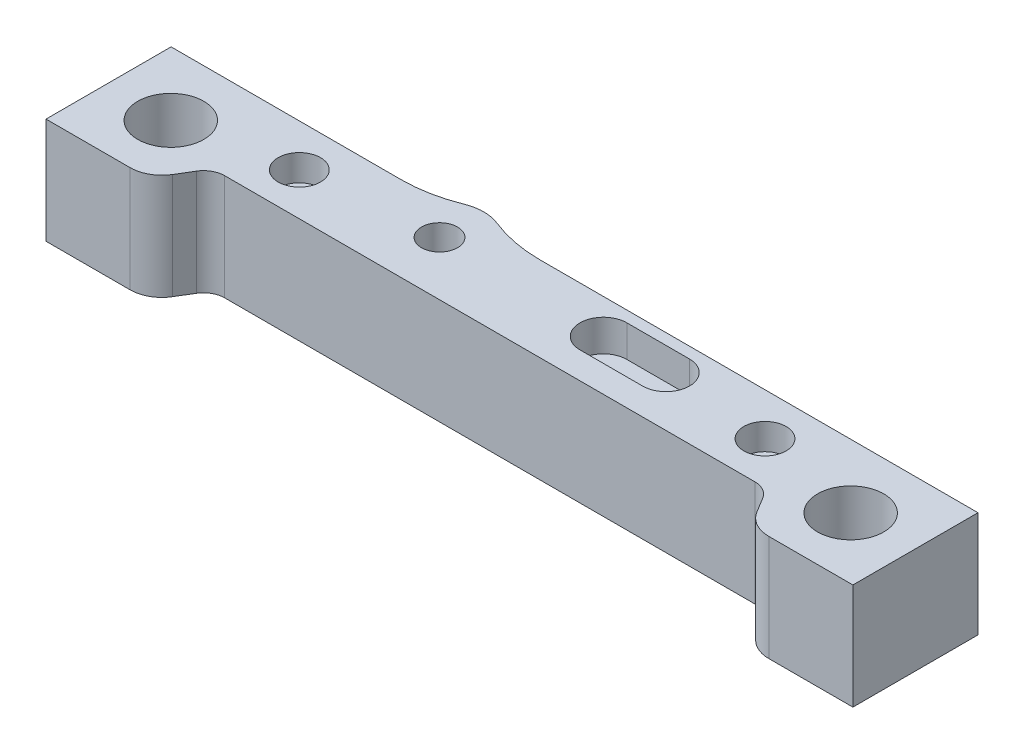
ISO-10303-21;
HEADER;
FILE_DESCRIPTION(('STEP AP214'),'2;1');
FILE_NAME('part.step','',(''),(''),'','','');
FILE_SCHEMA(('AUTOMOTIVE_DESIGN { 1 0 10303 214 1 1 1 1 }'));
ENDSEC;
DATA;
#1=APPLICATION_CONTEXT('core data for automotive mechanical design processes');
#2=APPLICATION_PROTOCOL_DEFINITION('international standard','automotive_design',2000,#1);
#3=PRODUCT_CONTEXT('',#1,'mechanical');
#4=PRODUCT('Part','Part','',(#3));
#5=PRODUCT_RELATED_PRODUCT_CATEGORY('part','',(#4));
#6=PRODUCT_DEFINITION_FORMATION('','',#4);
#7=PRODUCT_DEFINITION_CONTEXT('part definition',#1,'design');
#8=PRODUCT_DEFINITION('design','',#6,#7);
#9=PRODUCT_DEFINITION_SHAPE('','',#8);
#10=(LENGTH_UNIT() NAMED_UNIT(*) SI_UNIT(.MILLI.,.METRE.));
#11=(NAMED_UNIT(*) PLANE_ANGLE_UNIT() SI_UNIT($,.RADIAN.));
#12=(NAMED_UNIT(*) SI_UNIT($,.STERADIAN.) SOLID_ANGLE_UNIT());
#13=UNCERTAINTY_MEASURE_WITH_UNIT(LENGTH_MEASURE(1.E-05),#10,'distance_accuracy_value','');
#14=(GEOMETRIC_REPRESENTATION_CONTEXT(3) GLOBAL_UNCERTAINTY_ASSIGNED_CONTEXT((#13)) GLOBAL_UNIT_ASSIGNED_CONTEXT((#10,
#11,#12)) REPRESENTATION_CONTEXT('',''));
#15=CARTESIAN_POINT('',(0.,0.,0.));
#16=DIRECTION('',(0.,0.,1.));
#17=DIRECTION('',(1.,0.,0.));
#18=AXIS2_PLACEMENT_3D('',#15,#16,#17);
#19=CARTESIAN_POINT('',(22.,-14.2426406871193,-4.00499999999999));
#20=DIRECTION('',(0.,1.,0.));
#21=DIRECTION('',(0.,0.,1.));
#22=AXIS2_PLACEMENT_3D('',#19,#20,#21);
#23=CYLINDRICAL_SURFACE('',#22,1.5);
#24=CARTESIAN_POINT('',(22.,-2.48,-4.00499999999999));
#25=DIRECTION('',(0.,1.,0.));
#26=DIRECTION('',(0.,0.,1.));
#27=AXIS2_PLACEMENT_3D('',#24,#25,#26);
#28=CIRCLE('',#27,1.5);
#29=CARTESIAN_POINT('',(22.,-2.48,-2.50499999999999));
#30=VERTEX_POINT('',#29);
#31=EDGE_CURVE('E359',#30,#30,#28,.F.);
#32=ORIENTED_EDGE('',*,*,#31,.F.);
#33=EDGE_LOOP('',(#32));
#34=FACE_BOUND('',#33,.T.);
#35=CARTESIAN_POINT('',(22.,-7.2,-4.00499999999999));
#36=DIRECTION('',(0.,-1.,0.));
#37=DIRECTION('',(0.,0.,-1.));
#38=AXIS2_PLACEMENT_3D('',#35,#36,#37);
#39=CIRCLE('',#38,1.5);
#40=CARTESIAN_POINT('',(22.,-7.2,-5.50499999999999));
#41=VERTEX_POINT('',#40);
#42=EDGE_CURVE('E361',#41,#41,#39,.T.);
#43=ORIENTED_EDGE('',*,*,#42,.T.);
#44=EDGE_LOOP('',(#43));
#45=FACE_BOUND('',#44,.T.);
#46=ADVANCED_FACE('F43',(#34,#45),#23,.F.);
#47=CARTESIAN_POINT('',(0.,-10.,0.));
#48=DIRECTION('',(0.,1.,0.));
#49=DIRECTION('',(0.,0.,1.));
#50=AXIS2_PLACEMENT_3D('',#47,#48,#49);
#51=PLANE('',#50);
#52=CARTESIAN_POINT('',(22.,-10.,-4.00499999999999));
#53=DIRECTION('',(0.,-1.,0.));
#54=DIRECTION('',(0.,0.,-1.));
#55=AXIS2_PLACEMENT_3D('',#52,#53,#54);
#56=CIRCLE('',#55,2.725);
#57=CARTESIAN_POINT('',(22.,-10.,-6.72999999999999));
#58=VERTEX_POINT('',#57);
#59=EDGE_CURVE('E368',#58,#58,#56,.T.);
#60=ORIENTED_EDGE('',*,*,#59,.F.);
#61=EDGE_LOOP('',(#60));
#62=FACE_BOUND('',#61,.T.);
#63=CARTESIAN_POINT('',(-22.,-10.,-4.00499999999999));
#64=DIRECTION('',(0.,-1.,0.));
#65=DIRECTION('',(0.,0.,1.));
#66=AXIS2_PLACEMENT_3D('',#63,#64,#65);
#67=CIRCLE('',#66,2.725);
#68=CARTESIAN_POINT('',(-22.,-10.,-1.27999999999999));
#69=VERTEX_POINT('',#68);
#70=EDGE_CURVE('E373',#69,#69,#67,.T.);
#71=ORIENTED_EDGE('',*,*,#70,.F.);
#72=EDGE_LOOP('',(#71));
#73=FACE_BOUND('',#72,.T.);
#74=DIRECTION('',(-1.,0.,0.));
#75=VECTOR('',#74,1.);
#76=CARTESIAN_POINT('',(0.,-10.,3.80999999999997));
#77=LINE('',#76,#75);
#78=CARTESIAN_POINT('',(38.12,-10.,3.80999999999998));
#79=VERTEX_POINT('',#78);
#80=CARTESIAN_POINT('',(30.1715071075171,-10.,3.80999999999998));
#81=VERTEX_POINT('',#80);
#82=EDGE_CURVE('E262',#79,#81,#77,.T.);
#83=ORIENTED_EDGE('',*,*,#82,.T.);
#84=CARTESIAN_POINT('',(30.1715071075171,-10.,0.809999999999981));
#85=DIRECTION('',(0.,1.,0.));
#86=DIRECTION('',(0.,0.,1.));
#87=AXIS2_PLACEMENT_3D('',#84,#85,#86);
#88=CIRCLE('',#87,3.);
#89=CARTESIAN_POINT('',(27.6032012239419,-10.,2.36042087459919));
#90=VERTEX_POINT('',#89);
#91=EDGE_CURVE('E333',#81,#90,#88,.F.);
#92=ORIENTED_EDGE('',*,*,#91,.T.);
#93=DIRECTION('',(-0.516806958199737,0.,-0.856101961191735));
#94=VECTOR('',#93,1.);
#95=CARTESIAN_POINT('',(19.1863345718112,-10.,-11.5823017100173));
#96=LINE('',#95,#94);
#97=CARTESIAN_POINT('',(26.7616579117905,-10.,0.966386083600518));
#98=VERTEX_POINT('',#97);
#99=EDGE_CURVE('E259',#90,#98,#96,.T.);
#100=ORIENTED_EDGE('',*,*,#99,.T.);
#101=CARTESIAN_POINT('',(25.049453989407,-10.,1.99999999999999));
#102=DIRECTION('',(0.,1.,0.));
#103=DIRECTION('',(0.,0.,1.));
#104=AXIS2_PLACEMENT_3D('',#101,#102,#103);
#105=CIRCLE('',#104,2.);
#106=CARTESIAN_POINT('',(25.049453989407,-10.,0.));
#107=VERTEX_POINT('',#106);
#108=EDGE_CURVE('E353',#98,#107,#105,.T.);
#109=ORIENTED_EDGE('',*,*,#108,.T.);
#110=DIRECTION('',(-1.,0.,0.));
#111=VECTOR('',#110,1.);
#112=CARTESIAN_POINT('',(0.,-10.,0.));
#113=LINE('',#112,#111);
#114=CARTESIAN_POINT('',(-25.049453989407,-10.,0.));
#115=VERTEX_POINT('',#114);
#116=EDGE_CURVE('E257',#107,#115,#113,.T.);
#117=ORIENTED_EDGE('',*,*,#116,.T.);
#118=CARTESIAN_POINT('',(-25.049453989407,-10.,2.00000000000001));
#119=DIRECTION('',(0.,1.,0.));
#120=DIRECTION('',(0.,0.,1.));
#121=AXIS2_PLACEMENT_3D('',#118,#119,#120);
#122=CIRCLE('',#121,2.);
#123=CARTESIAN_POINT('',(-26.7616579117905,-10.,0.966386083600536));
#124=VERTEX_POINT('',#123);
#125=EDGE_CURVE('E11',#115,#124,#122,.T.);
#126=ORIENTED_EDGE('',*,*,#125,.T.);
#127=DIRECTION('',(-0.516806958199737,0.,0.856101961191735));
#128=VECTOR('',#127,1.);
#129=CARTESIAN_POINT('',(-19.1863345718112,-10.,-11.5823017100173));
#130=LINE('',#129,#128);
#131=CARTESIAN_POINT('',(-27.6032012239419,-10.,2.36042087459921));
#132=VERTEX_POINT('',#131);
#133=EDGE_CURVE('E255',#124,#132,#130,.T.);
#134=ORIENTED_EDGE('',*,*,#133,.T.);
#135=CARTESIAN_POINT('',(-30.1715071075171,-10.,0.809999999999999));
#136=DIRECTION('',(0.,1.,0.));
#137=DIRECTION('',(0.,0.,1.));
#138=AXIS2_PLACEMENT_3D('',#135,#136,#137);
#139=CIRCLE('',#138,3.);
#140=CARTESIAN_POINT('',(-30.1715071075171,-10.,3.81));
#141=VERTEX_POINT('',#140);
#142=EDGE_CURVE('E331',#132,#141,#139,.F.);
#143=ORIENTED_EDGE('',*,*,#142,.T.);
#144=DIRECTION('',(-1.,0.,0.));
#145=VECTOR('',#144,1.);
#146=CARTESIAN_POINT('',(0.,-10.,3.80999999999997));
#147=LINE('',#146,#145);
#148=CARTESIAN_POINT('',(-38.12,-10.,3.81000000000001));
#149=VERTEX_POINT('',#148);
#150=EDGE_CURVE('E253',#141,#149,#147,.T.);
#151=ORIENTED_EDGE('',*,*,#150,.T.);
#152=DIRECTION('',(0.,0.,-1.));
#153=VECTOR('',#152,1.);
#154=CARTESIAN_POINT('',(-38.12,-10.,0.));
#155=LINE('',#154,#153);
#156=CARTESIAN_POINT('',(-38.12,-10.,-8.01));
#157=VERTEX_POINT('',#156);
#158=EDGE_CURVE('E251',#149,#157,#155,.T.);
#159=ORIENTED_EDGE('',*,*,#158,.T.);
#160=DIRECTION('',(1.,0.,0.));
#161=VECTOR('',#160,1.);
#162=CARTESIAN_POINT('',(0.,-10.,-8.00999999999998));
#163=LINE('',#162,#161);
#164=CARTESIAN_POINT('',(-16.4092450938548,-10.,-8.00999999999999));
#165=VERTEX_POINT('',#164);
#166=EDGE_CURVE('E249',#157,#165,#163,.T.);
#167=ORIENTED_EDGE('',*,*,#166,.T.);
#168=CARTESIAN_POINT('',(-16.4092450938548,-10.,-21.4073898813991));
#169=DIRECTION('',(0.,1.,0.));
#170=DIRECTION('',(0.,0.,1.));
#171=AXIS2_PLACEMENT_3D('',#168,#169,#170);
#172=CIRCLE('',#171,13.3973898813991);
#173=CARTESIAN_POINT('',(-11.4092450938548,-10.,-8.97798701423708));
#174=VERTEX_POINT('',#173);
#175=EDGE_CURVE('E245',#174,#165,#172,.F.);
#176=ORIENTED_EDGE('',*,*,#175,.F.);
#177=CARTESIAN_POINT('',(-9.84923973572024,-10.,-5.09999999999998));
#178=DIRECTION('',(0.,1.,0.));
#179=DIRECTION('',(0.,0.,1.));
#180=AXIS2_PLACEMENT_3D('',#177,#178,#179);
#181=CIRCLE('',#180,4.18);
#182=CARTESIAN_POINT('',(-8.2892343775857,-10.,-8.97798701423708));
#183=VERTEX_POINT('',#182);
#184=EDGE_CURVE('E242',#174,#183,#181,.F.);
#185=ORIENTED_EDGE('',*,*,#184,.T.);
#186=CARTESIAN_POINT('',(-3.2892343775857,-10.,-21.4073898813991));
#187=DIRECTION('',(0.,1.,0.));
#188=DIRECTION('',(0.,0.,1.));
#189=AXIS2_PLACEMENT_3D('',#186,#187,#188);
#190=CIRCLE('',#189,13.3973898813991);
#191=CARTESIAN_POINT('',(-3.2892343775857,-10.,-8.00999999999999));
#192=VERTEX_POINT('',#191);
#193=EDGE_CURVE('E269',#183,#192,#190,.T.);
#194=ORIENTED_EDGE('',*,*,#193,.T.);
#195=DIRECTION('',(1.,0.,0.));
#196=VECTOR('',#195,1.);
#197=CARTESIAN_POINT('',(0.,-10.,-8.00999999999999));
#198=LINE('',#197,#196);
#199=CARTESIAN_POINT('',(38.12,-10.,-8.01000000000002));
#200=VERTEX_POINT('',#199);
#201=EDGE_CURVE('E267',#192,#200,#198,.T.);
#202=ORIENTED_EDGE('',*,*,#201,.T.);
#203=DIRECTION('',(0.,0.,1.));
#204=VECTOR('',#203,1.);
#205=CARTESIAN_POINT('',(38.12,-10.,0.));
#206=LINE('',#205,#204);
#207=EDGE_CURVE('E265',#200,#79,#206,.T.);
#208=ORIENTED_EDGE('',*,*,#207,.T.);
#209=EDGE_LOOP('',(#83,#92,#100,#109,#117,#126,#134,#143,#151,#159,#167,#176,#185,#194,#202,#208));
#210=FACE_BOUND('',#209,.T.);
#211=CARTESIAN_POINT('',(-9.84923973572024,-10.,-5.09999999999998));
#212=DIRECTION('',(0.,1.,0.));
#213=DIRECTION('',(0.,0.,1.));
#214=AXIS2_PLACEMENT_3D('',#211,#212,#213);
#215=CIRCLE('',#214,1.7);
#216=CARTESIAN_POINT('',(-9.84923973572024,-10.,-3.39999999999999));
#217=VERTEX_POINT('',#216);
#218=EDGE_CURVE('E226',#217,#217,#215,.F.);
#219=ORIENTED_EDGE('',*,*,#218,.F.);
#220=EDGE_LOOP('',(#219));
#221=FACE_BOUND('',#220,.T.);
#222=ADVANCED_FACE('F408',(#62,#73,#210,#221),#51,.F.);
#223=CARTESIAN_POINT('',(0.,0.,0.));
#224=DIRECTION('',(0.,1.,0.));
#225=DIRECTION('',(0.,0.,1.));
#226=AXIS2_PLACEMENT_3D('',#223,#224,#225);
#227=PLANE('',#226);
#228=CARTESIAN_POINT('',(22.,0.,-4.00499999999999));
#229=DIRECTION('',(0.,1.,0.));
#230=DIRECTION('',(0.,0.,1.));
#231=AXIS2_PLACEMENT_3D('',#228,#229,#230);
#232=CIRCLE('',#231,2.);
#233=CARTESIAN_POINT('',(22.,0.,-2.00499999999999));
#234=VERTEX_POINT('',#233);
#235=EDGE_CURVE('E207',#234,#234,#232,.F.);
#236=ORIENTED_EDGE('',*,*,#235,.T.);
#237=EDGE_LOOP('',(#236));
#238=FACE_BOUND('',#237,.T.);
#239=DIRECTION('',(1.,0.,0.));
#240=VECTOR('',#239,1.);
#241=CARTESIAN_POINT('',(0.,0.,-2.52999999999999));
#242=LINE('',#241,#240);
#243=CARTESIAN_POINT('',(5.99210502631991,0.,-2.52999999999999));
#244=VERTEX_POINT('',#243);
#245=CARTESIAN_POINT('',(11.9121050263199,0.,-2.52999999999999));
#246=VERTEX_POINT('',#245);
#247=EDGE_CURVE('E60',#244,#246,#242,.T.);
#248=ORIENTED_EDGE('',*,*,#247,.F.);
#249=CARTESIAN_POINT('',(5.99210502631991,0.,-4.74499999999999));
#250=DIRECTION('',(0.,1.,0.));
#251=DIRECTION('',(0.,0.,1.));
#252=AXIS2_PLACEMENT_3D('',#249,#250,#251);
#253=CIRCLE('',#252,2.215);
#254=CARTESIAN_POINT('',(5.99210502631991,0.,-6.95999999999999));
#255=VERTEX_POINT('',#254);
#256=EDGE_CURVE('E201',#255,#244,#253,.T.);
#257=ORIENTED_EDGE('',*,*,#256,.F.);
#258=DIRECTION('',(1.,0.,0.));
#259=VECTOR('',#258,1.);
#260=CARTESIAN_POINT('',(0.,0.,-6.95999999999999));
#261=LINE('',#260,#259);
#262=CARTESIAN_POINT('',(11.9121050263199,0.,-6.95999999999999));
#263=VERTEX_POINT('',#262);
#264=EDGE_CURVE('E204',#255,#263,#261,.T.);
#265=ORIENTED_EDGE('',*,*,#264,.T.);
#266=CARTESIAN_POINT('',(11.9121050263199,0.,-4.74499999999999));
#267=DIRECTION('',(0.,1.,0.));
#268=DIRECTION('',(0.,0.,1.));
#269=AXIS2_PLACEMENT_3D('',#266,#267,#268);
#270=CIRCLE('',#269,2.215);
#271=EDGE_CURVE('E213',#246,#263,#270,.T.);
#272=ORIENTED_EDGE('',*,*,#271,.F.);
#273=EDGE_LOOP('',(#248,#257,#265,#272));
#274=FACE_BOUND('',#273,.T.);
#275=CARTESIAN_POINT('',(-9.84923973572024,0.,-5.09999999999998));
#276=DIRECTION('',(0.,1.,0.));
#277=DIRECTION('',(0.,0.,1.));
#278=AXIS2_PLACEMENT_3D('',#275,#276,#277);
#279=CIRCLE('',#278,1.7);
#280=CARTESIAN_POINT('',(-9.84923973572024,0.,-3.39999999999999));
#281=VERTEX_POINT('',#280);
#282=EDGE_CURVE('E220',#281,#281,#279,.T.);
#283=ORIENTED_EDGE('',*,*,#282,.F.);
#284=EDGE_LOOP('',(#283));
#285=FACE_BOUND('',#284,.T.);
#286=DIRECTION('',(-0.516806958199737,0.,-0.856101961191735));
#287=VECTOR('',#286,1.);
#288=CARTESIAN_POINT('',(19.1863345718112,0.,-11.5823017100173));
#289=LINE('',#288,#287);
#290=CARTESIAN_POINT('',(27.6032012239419,0.,2.36042087459919));
#291=VERTEX_POINT('',#290);
#292=CARTESIAN_POINT('',(26.7616579117905,0.,0.966386083600518));
#293=VERTEX_POINT('',#292);
#294=EDGE_CURVE('E289',#291,#293,#289,.T.);
#295=ORIENTED_EDGE('',*,*,#294,.F.);
#296=CARTESIAN_POINT('',(30.1715071075171,0.,0.809999999999981));
#297=DIRECTION('',(0.,1.,0.));
#298=DIRECTION('',(0.,0.,1.));
#299=AXIS2_PLACEMENT_3D('',#296,#297,#298);
#300=CIRCLE('',#299,3.);
#301=CARTESIAN_POINT('',(30.1715071075171,0.,3.80999999999998));
#302=VERTEX_POINT('',#301);
#303=EDGE_CURVE('E327',#291,#302,#300,.T.);
#304=ORIENTED_EDGE('',*,*,#303,.T.);
#305=DIRECTION('',(-1.,0.,0.));
#306=VECTOR('',#305,1.);
#307=CARTESIAN_POINT('',(0.,0.,3.80999999999997));
#308=LINE('',#307,#306);
#309=CARTESIAN_POINT('',(38.12,0.,3.80999999999998));
#310=VERTEX_POINT('',#309);
#311=EDGE_CURVE('E292',#310,#302,#308,.T.);
#312=ORIENTED_EDGE('',*,*,#311,.F.);
#313=DIRECTION('',(0.,0.,1.));
#314=VECTOR('',#313,1.);
#315=CARTESIAN_POINT('',(38.12,0.,0.));
#316=LINE('',#315,#314);
#317=CARTESIAN_POINT('',(38.12,0.,-8.01000000000002));
#318=VERTEX_POINT('',#317);
#319=EDGE_CURVE('E295',#318,#310,#316,.T.);
#320=ORIENTED_EDGE('',*,*,#319,.F.);
#321=DIRECTION('',(1.,0.,0.));
#322=VECTOR('',#321,1.);
#323=CARTESIAN_POINT('',(0.,0.,-8.00999999999999));
#324=LINE('',#323,#322);
#325=CARTESIAN_POINT('',(-3.2892343775857,0.,-8.00999999999999));
#326=VERTEX_POINT('',#325);
#327=EDGE_CURVE('E297',#326,#318,#324,.T.);
#328=ORIENTED_EDGE('',*,*,#327,.F.);
#329=CARTESIAN_POINT('',(-3.2892343775857,0.,-21.4073898813991));
#330=DIRECTION('',(0.,1.,0.));
#331=DIRECTION('',(0.,0.,1.));
#332=AXIS2_PLACEMENT_3D('',#329,#330,#331);
#333=CIRCLE('',#332,13.3973898813991);
#334=CARTESIAN_POINT('',(-8.2892343775857,0.,-8.97798701423708));
#335=VERTEX_POINT('',#334);
#336=EDGE_CURVE('E246',#335,#326,#333,.T.);
#337=ORIENTED_EDGE('',*,*,#336,.F.);
#338=CARTESIAN_POINT('',(-9.84923973572024,0.,-5.09999999999998));
#339=DIRECTION('',(0.,1.,0.));
#340=DIRECTION('',(0.,0.,1.));
#341=AXIS2_PLACEMENT_3D('',#338,#339,#340);
#342=CIRCLE('',#341,4.18);
#343=CARTESIAN_POINT('',(-11.4092450938548,0.,-8.97798701423708));
#344=VERTEX_POINT('',#343);
#345=EDGE_CURVE('E233',#344,#335,#342,.F.);
#346=ORIENTED_EDGE('',*,*,#345,.F.);
#347=CARTESIAN_POINT('',(-16.4092450938548,0.,-21.4073898813991));
#348=DIRECTION('',(0.,1.,0.));
#349=DIRECTION('',(0.,0.,1.));
#350=AXIS2_PLACEMENT_3D('',#347,#348,#349);
#351=CIRCLE('',#350,13.3973898813991);
#352=CARTESIAN_POINT('',(-16.4092450938548,0.,-8.00999999999999));
#353=VERTEX_POINT('',#352);
#354=EDGE_CURVE('E274',#344,#353,#351,.F.);
#355=ORIENTED_EDGE('',*,*,#354,.T.);
#356=DIRECTION('',(1.,0.,0.));
#357=VECTOR('',#356,1.);
#358=CARTESIAN_POINT('',(0.,0.,-8.00999999999998));
#359=LINE('',#358,#357);
#360=CARTESIAN_POINT('',(-38.12,0.,-8.01));
#361=VERTEX_POINT('',#360);
#362=EDGE_CURVE('E277',#361,#353,#359,.T.);
#363=ORIENTED_EDGE('',*,*,#362,.F.);
#364=DIRECTION('',(0.,0.,-1.));
#365=VECTOR('',#364,1.);
#366=CARTESIAN_POINT('',(-38.12,0.,0.));
#367=LINE('',#366,#365);
#368=CARTESIAN_POINT('',(-38.12,0.,3.81000000000001));
#369=VERTEX_POINT('',#368);
#370=EDGE_CURVE('E280',#369,#361,#367,.T.);
#371=ORIENTED_EDGE('',*,*,#370,.F.);
#372=DIRECTION('',(-1.,0.,0.));
#373=VECTOR('',#372,1.);
#374=CARTESIAN_POINT('',(0.,0.,3.80999999999997));
#375=LINE('',#374,#373);
#376=CARTESIAN_POINT('',(-30.1715071075171,0.,3.81));
#377=VERTEX_POINT('',#376);
#378=EDGE_CURVE('E282',#377,#369,#375,.T.);
#379=ORIENTED_EDGE('',*,*,#378,.F.);
#380=CARTESIAN_POINT('',(-30.1715071075171,0.,0.809999999999999));
#381=DIRECTION('',(0.,1.,0.));
#382=DIRECTION('',(0.,0.,1.));
#383=AXIS2_PLACEMENT_3D('',#380,#381,#382);
#384=CIRCLE('',#383,3.);
#385=CARTESIAN_POINT('',(-27.6032012239419,0.,2.36042087459921));
#386=VERTEX_POINT('',#385);
#387=EDGE_CURVE('E324',#377,#386,#384,.T.);
#388=ORIENTED_EDGE('',*,*,#387,.T.);
#389=DIRECTION('',(-0.516806958199737,0.,0.856101961191735));
#390=VECTOR('',#389,1.);
#391=CARTESIAN_POINT('',(-19.1863345718112,0.,-11.5823017100173));
#392=LINE('',#391,#390);
#393=CARTESIAN_POINT('',(-26.7616579117905,0.,0.966386083600536));
#394=VERTEX_POINT('',#393);
#395=EDGE_CURVE('E284',#394,#386,#392,.T.);
#396=ORIENTED_EDGE('',*,*,#395,.F.);
#397=CARTESIAN_POINT('',(-25.049453989407,0.,2.00000000000001));
#398=DIRECTION('',(0.,1.,0.));
#399=DIRECTION('',(0.,0.,1.));
#400=AXIS2_PLACEMENT_3D('',#397,#398,#399);
#401=CIRCLE('',#400,2.);
#402=CARTESIAN_POINT('',(-25.049453989407,0.,0.));
#403=VERTEX_POINT('',#402);
#404=EDGE_CURVE('E52',#394,#403,#401,.F.);
#405=ORIENTED_EDGE('',*,*,#404,.T.);
#406=DIRECTION('',(-1.,0.,0.));
#407=VECTOR('',#406,1.);
#408=CARTESIAN_POINT('',(0.,0.,0.));
#409=LINE('',#408,#407);
#410=CARTESIAN_POINT('',(25.049453989407,0.,0.));
#411=VERTEX_POINT('',#410);
#412=EDGE_CURVE('E286',#411,#403,#409,.T.);
#413=ORIENTED_EDGE('',*,*,#412,.F.);
#414=CARTESIAN_POINT('',(25.049453989407,0.,1.99999999999999));
#415=DIRECTION('',(0.,1.,0.));
#416=DIRECTION('',(0.,0.,1.));
#417=AXIS2_PLACEMENT_3D('',#414,#415,#416);
#418=CIRCLE('',#417,2.);
#419=EDGE_CURVE('E351',#411,#293,#418,.F.);
#420=ORIENTED_EDGE('',*,*,#419,.T.);
#421=EDGE_LOOP('',(#295,#304,#312,#320,#328,#337,#346,#355,#363,#371,#379,#388,#396,#405,#413,#420));
#422=FACE_BOUND('',#421,.T.);
#423=CARTESIAN_POINT('',(-32.12,0.,-1.98));
#424=DIRECTION('',(0.,1.,0.));
#425=DIRECTION('',(0.,0.,1.));
#426=AXIS2_PLACEMENT_3D('',#423,#424,#425);
#427=CIRCLE('',#426,3.125);
#428=CARTESIAN_POINT('',(-32.12,0.,1.145));
#429=VERTEX_POINT('',#428);
#430=EDGE_CURVE('E237',#429,#429,#427,.T.);
#431=ORIENTED_EDGE('',*,*,#430,.F.);
#432=EDGE_LOOP('',(#431));
#433=FACE_BOUND('',#432,.T.);
#434=CARTESIAN_POINT('',(32.12,0.,-1.98));
#435=DIRECTION('',(0.,1.,0.));
#436=DIRECTION('',(0.,0.,1.));
#437=AXIS2_PLACEMENT_3D('',#434,#435,#436);
#438=CIRCLE('',#437,3.125);
#439=CARTESIAN_POINT('',(32.12,0.,1.14500000000001));
#440=VERTEX_POINT('',#439);
#441=EDGE_CURVE('E234',#440,#440,#438,.F.);
#442=ORIENTED_EDGE('',*,*,#441,.T.);
#443=EDGE_LOOP('',(#442));
#444=FACE_BOUND('',#443,.T.);
#445=CARTESIAN_POINT('',(-22.,0.,-4.00499999999999));
#446=DIRECTION('',(0.,1.,0.));
#447=DIRECTION('',(0.,0.,1.));
#448=AXIS2_PLACEMENT_3D('',#445,#446,#447);
#449=CIRCLE('',#448,2.);
#450=CARTESIAN_POINT('',(-22.,0.,-2.00499999999999));
#451=VERTEX_POINT('',#450);
#452=EDGE_CURVE('E383',#451,#451,#449,.T.);
#453=ORIENTED_EDGE('',*,*,#452,.F.);
#454=EDGE_LOOP('',(#453));
#455=FACE_BOUND('',#454,.T.);
#456=ADVANCED_FACE('F392',(#238,#274,#285,#422,#433,#444,#455),#227,.T.);
#457=CARTESIAN_POINT('',(-9.84923973572024,-10.,-5.09999999999998));
#458=DIRECTION('',(0.,1.,0.));
#459=DIRECTION('',(0.,0.,1.));
#460=AXIS2_PLACEMENT_3D('',#457,#458,#459);
#461=CYLINDRICAL_SURFACE('',#460,4.18);
#462=ORIENTED_EDGE('',*,*,#345,.T.);
#463=DIRECTION('',(0.,1.,0.));
#464=VECTOR('',#463,1.);
#465=CARTESIAN_POINT('',(-8.2892343775857,-10.,-8.97798701423708));
#466=LINE('',#465,#464);
#467=EDGE_CURVE('E300',#183,#335,#466,.T.);
#468=ORIENTED_EDGE('',*,*,#467,.F.);
#469=ORIENTED_EDGE('',*,*,#184,.F.);
#470=DIRECTION('',(0.,1.,0.));
#471=VECTOR('',#470,1.);
#472=CARTESIAN_POINT('',(-11.4092450938548,-10.,-8.97798701423708));
#473=LINE('',#472,#471);
#474=EDGE_CURVE('E271',#174,#344,#473,.T.);
#475=ORIENTED_EDGE('',*,*,#474,.T.);
#476=EDGE_LOOP('',(#462,#468,#469,#475));
#477=FACE_BOUND('',#476,.T.);
#478=ADVANCED_FACE('F434',(#477),#461,.T.);
#479=CARTESIAN_POINT('',(-3.2892343775857,-10.,-21.4073898813991));
#480=DIRECTION('',(0.,1.,0.));
#481=DIRECTION('',(0.,0.,1.));
#482=AXIS2_PLACEMENT_3D('',#479,#480,#481);
#483=CYLINDRICAL_SURFACE('',#482,13.3973898813991);
#484=ORIENTED_EDGE('',*,*,#336,.T.);
#485=DIRECTION('',(0.,1.,0.));
#486=VECTOR('',#485,1.);
#487=CARTESIAN_POINT('',(-3.2892343775857,-10.,-8.00999999999999));
#488=LINE('',#487,#486);
#489=EDGE_CURVE('E304',#192,#326,#488,.T.);
#490=ORIENTED_EDGE('',*,*,#489,.F.);
#491=ORIENTED_EDGE('',*,*,#193,.F.);
#492=ORIENTED_EDGE('',*,*,#467,.T.);
#493=EDGE_LOOP('',(#484,#490,#491,#492));
#494=FACE_BOUND('',#493,.T.);
#495=ADVANCED_FACE('F439',(#494),#483,.F.);
#496=CARTESIAN_POINT('',(0.,-10.,-8.00999999999999));
#497=DIRECTION('',(0.,0.,1.));
#498=DIRECTION('',(1.,0.,0.));
#499=AXIS2_PLACEMENT_3D('',#496,#497,#498);
#500=PLANE('',#499);
#501=ORIENTED_EDGE('',*,*,#327,.T.);
#502=DIRECTION('',(0.,1.,0.));
#503=VECTOR('',#502,1.);
#504=CARTESIAN_POINT('',(38.12,-10.,-8.01000000000002));
#505=LINE('',#504,#503);
#506=EDGE_CURVE('E307',#200,#318,#505,.T.);
#507=ORIENTED_EDGE('',*,*,#506,.F.);
#508=ORIENTED_EDGE('',*,*,#201,.F.);
#509=ORIENTED_EDGE('',*,*,#489,.T.);
#510=EDGE_LOOP('',(#501,#507,#508,#509));
#511=FACE_BOUND('',#510,.T.);
#512=ADVANCED_FACE('F446',(#511),#500,.F.);
#513=CARTESIAN_POINT('',(38.12,-10.,0.));
#514=DIRECTION('',(-1.,0.,0.));
#515=DIRECTION('',(0.,0.,1.));
#516=AXIS2_PLACEMENT_3D('',#513,#514,#515);
#517=PLANE('',#516);
#518=ORIENTED_EDGE('',*,*,#319,.T.);
#519=DIRECTION('',(0.,1.,0.));
#520=VECTOR('',#519,1.);
#521=CARTESIAN_POINT('',(38.12,-10.,3.80999999999998));
#522=LINE('',#521,#520);
#523=EDGE_CURVE('E310',#79,#310,#522,.T.);
#524=ORIENTED_EDGE('',*,*,#523,.F.);
#525=ORIENTED_EDGE('',*,*,#207,.F.);
#526=ORIENTED_EDGE('',*,*,#506,.T.);
#527=EDGE_LOOP('',(#518,#524,#525,#526));
#528=FACE_BOUND('',#527,.T.);
#529=ADVANCED_FACE('F450',(#528),#517,.F.);
#530=CARTESIAN_POINT('',(0.,-10.,3.80999999999997));
#531=DIRECTION('',(0.,0.,-1.));
#532=DIRECTION('',(-1.,0.,0.));
#533=AXIS2_PLACEMENT_3D('',#530,#531,#532);
#534=PLANE('',#533);
#535=ORIENTED_EDGE('',*,*,#311,.T.);
#536=DIRECTION('',(0.,1.,0.));
#537=VECTOR('',#536,1.);
#538=CARTESIAN_POINT('',(30.1715071075171,-10.,3.80999999999998));
#539=LINE('',#538,#537);
#540=EDGE_CURVE('E329',#302,#81,#539,.F.);
#541=ORIENTED_EDGE('',*,*,#540,.T.);
#542=ORIENTED_EDGE('',*,*,#82,.F.);
#543=ORIENTED_EDGE('',*,*,#523,.T.);
#544=EDGE_LOOP('',(#535,#541,#542,#543));
#545=FACE_BOUND('',#544,.T.);
#546=ADVANCED_FACE('F454',(#545),#534,.F.);
#547=CARTESIAN_POINT('',(19.1863345718112,-10.,-11.5823017100173));
#548=DIRECTION('',(0.856101961191735,0.,-0.516806958199737));
#549=DIRECTION('',(-0.516806958199737,0.,-0.856101961191735));
#550=AXIS2_PLACEMENT_3D('',#547,#548,#549);
#551=PLANE('',#550);
#552=ORIENTED_EDGE('',*,*,#294,.T.);
#553=DIRECTION('',(0.,1.,0.));
#554=VECTOR('',#553,1.);
#555=CARTESIAN_POINT('',(26.7616579117905,-10.,0.96638608360052));
#556=LINE('',#555,#554);
#557=EDGE_CURVE('E346',#293,#98,#556,.F.);
#558=ORIENTED_EDGE('',*,*,#557,.T.);
#559=ORIENTED_EDGE('',*,*,#99,.F.);
#560=DIRECTION('',(0.,1.,0.));
#561=VECTOR('',#560,1.);
#562=CARTESIAN_POINT('',(27.6032012239419,-10.,2.36042087459919));
#563=LINE('',#562,#561);
#564=EDGE_CURVE('E303',#90,#291,#563,.T.);
#565=ORIENTED_EDGE('',*,*,#564,.T.);
#566=EDGE_LOOP('',(#552,#558,#559,#565));
#567=FACE_BOUND('',#566,.T.);
#568=ADVANCED_FACE('F458',(#567),#551,.F.);
#569=CARTESIAN_POINT('',(0.,-10.,0.));
#570=DIRECTION('',(0.,0.,-1.));
#571=DIRECTION('',(-1.,0.,0.));
#572=AXIS2_PLACEMENT_3D('',#569,#570,#571);
#573=PLANE('',#572);
#574=ORIENTED_EDGE('',*,*,#116,.F.);
#575=DIRECTION('',(0.,1.,0.));
#576=VECTOR('',#575,1.);
#577=CARTESIAN_POINT('',(25.049453989407,0.,0.));
#578=LINE('',#577,#576);
#579=EDGE_CURVE('E343',#107,#411,#578,.T.);
#580=ORIENTED_EDGE('',*,*,#579,.T.);
#581=ORIENTED_EDGE('',*,*,#412,.T.);
#582=DIRECTION('',(0.,1.,0.));
#583=VECTOR('',#582,1.);
#584=CARTESIAN_POINT('',(-25.049453989407,-10.,0.));
#585=LINE('',#584,#583);
#586=EDGE_CURVE('E341',#403,#115,#585,.F.);
#587=ORIENTED_EDGE('',*,*,#586,.T.);
#588=EDGE_LOOP('',(#574,#580,#581,#587));
#589=FACE_BOUND('',#588,.T.);
#590=ADVANCED_FACE('F462',(#589),#573,.F.);
#591=CARTESIAN_POINT('',(-19.1863345718112,-10.,-11.5823017100173));
#592=DIRECTION('',(-0.856101961191735,0.,-0.516806958199737));
#593=DIRECTION('',(-0.516806958199737,0.,0.856101961191735));
#594=AXIS2_PLACEMENT_3D('',#591,#592,#593);
#595=PLANE('',#594);
#596=ORIENTED_EDGE('',*,*,#133,.F.);
#597=DIRECTION('',(0.,1.,0.));
#598=VECTOR('',#597,1.);
#599=CARTESIAN_POINT('',(-26.7616579117905,0.,0.966386083600533));
#600=LINE('',#599,#598);
#601=EDGE_CURVE('E348',#124,#394,#600,.T.);
#602=ORIENTED_EDGE('',*,*,#601,.T.);
#603=ORIENTED_EDGE('',*,*,#395,.T.);
#604=DIRECTION('',(0.,1.,0.));
#605=VECTOR('',#604,1.);
#606=CARTESIAN_POINT('',(-27.6032012239419,-10.,2.36042087459921));
#607=LINE('',#606,#605);
#608=EDGE_CURVE('E338',#386,#132,#607,.F.);
#609=ORIENTED_EDGE('',*,*,#608,.T.);
#610=EDGE_LOOP('',(#596,#602,#603,#609));
#611=FACE_BOUND('',#610,.T.);
#612=ADVANCED_FACE('F466',(#611),#595,.F.);
#613=CARTESIAN_POINT('',(0.,-10.,3.80999999999997));
#614=DIRECTION('',(0.,0.,-1.));
#615=DIRECTION('',(-1.,0.,0.));
#616=AXIS2_PLACEMENT_3D('',#613,#614,#615);
#617=PLANE('',#616);
#618=ORIENTED_EDGE('',*,*,#150,.F.);
#619=DIRECTION('',(0.,1.,0.));
#620=VECTOR('',#619,1.);
#621=CARTESIAN_POINT('',(-30.1715071075171,-10.,3.81));
#622=LINE('',#621,#620);
#623=EDGE_CURVE('E335',#141,#377,#622,.T.);
#624=ORIENTED_EDGE('',*,*,#623,.T.);
#625=ORIENTED_EDGE('',*,*,#378,.T.);
#626=DIRECTION('',(0.,1.,0.));
#627=VECTOR('',#626,1.);
#628=CARTESIAN_POINT('',(-38.12,-10.,3.81000000000001));
#629=LINE('',#628,#627);
#630=EDGE_CURVE('E313',#149,#369,#629,.T.);
#631=ORIENTED_EDGE('',*,*,#630,.F.);
#632=EDGE_LOOP('',(#618,#624,#625,#631));
#633=FACE_BOUND('',#632,.T.);
#634=ADVANCED_FACE('F470',(#633),#617,.F.);
#635=CARTESIAN_POINT('',(-38.12,-10.,0.));
#636=DIRECTION('',(1.,0.,0.));
#637=DIRECTION('',(0.,0.,-1.));
#638=AXIS2_PLACEMENT_3D('',#635,#636,#637);
#639=PLANE('',#638);
#640=ORIENTED_EDGE('',*,*,#370,.T.);
#641=DIRECTION('',(0.,1.,0.));
#642=VECTOR('',#641,1.);
#643=CARTESIAN_POINT('',(-38.12,-10.,-8.01));
#644=LINE('',#643,#642);
#645=EDGE_CURVE('E316',#157,#361,#644,.T.);
#646=ORIENTED_EDGE('',*,*,#645,.F.);
#647=ORIENTED_EDGE('',*,*,#158,.F.);
#648=ORIENTED_EDGE('',*,*,#630,.T.);
#649=EDGE_LOOP('',(#640,#646,#647,#648));
#650=FACE_BOUND('',#649,.T.);
#651=ADVANCED_FACE('F474',(#650),#639,.F.);
#652=CARTESIAN_POINT('',(0.,-10.,-8.00999999999998));
#653=DIRECTION('',(0.,0.,1.));
#654=DIRECTION('',(1.,0.,0.));
#655=AXIS2_PLACEMENT_3D('',#652,#653,#654);
#656=PLANE('',#655);
#657=ORIENTED_EDGE('',*,*,#362,.T.);
#658=DIRECTION('',(0.,1.,0.));
#659=VECTOR('',#658,1.);
#660=CARTESIAN_POINT('',(-16.4092450938548,-10.,-8.00999999999999));
#661=LINE('',#660,#659);
#662=EDGE_CURVE('E319',#165,#353,#661,.T.);
#663=ORIENTED_EDGE('',*,*,#662,.F.);
#664=ORIENTED_EDGE('',*,*,#166,.F.);
#665=ORIENTED_EDGE('',*,*,#645,.T.);
#666=EDGE_LOOP('',(#657,#663,#664,#665));
#667=FACE_BOUND('',#666,.T.);
#668=ADVANCED_FACE('F478',(#667),#656,.F.);
#669=CARTESIAN_POINT('',(-16.4092450938548,-10.,-21.4073898813991));
#670=DIRECTION('',(0.,1.,0.));
#671=DIRECTION('',(0.,0.,1.));
#672=AXIS2_PLACEMENT_3D('',#669,#670,#671);
#673=CYLINDRICAL_SURFACE('',#672,13.3973898813991);
#674=ORIENTED_EDGE('',*,*,#354,.F.);
#675=ORIENTED_EDGE('',*,*,#474,.F.);
#676=ORIENTED_EDGE('',*,*,#175,.T.);
#677=ORIENTED_EDGE('',*,*,#662,.T.);
#678=EDGE_LOOP('',(#674,#675,#676,#677));
#679=FACE_BOUND('',#678,.T.);
#680=ADVANCED_FACE('F482',(#679),#673,.F.);
#681=CARTESIAN_POINT('',(30.1715071075171,-10.,0.809999999999981));
#682=DIRECTION('',(0.,1.,0.));
#683=DIRECTION('',(0.,0.,1.));
#684=AXIS2_PLACEMENT_3D('',#681,#682,#683);
#685=CYLINDRICAL_SURFACE('',#684,3.);
#686=ORIENTED_EDGE('',*,*,#91,.F.);
#687=ORIENTED_EDGE('',*,*,#540,.F.);
#688=ORIENTED_EDGE('',*,*,#303,.F.);
#689=ORIENTED_EDGE('',*,*,#564,.F.);
#690=EDGE_LOOP('',(#686,#687,#688,#689));
#691=FACE_BOUND('',#690,.T.);
#692=ADVANCED_FACE('F485',(#691),#685,.T.);
#693=CARTESIAN_POINT('',(-30.1715071075171,-10.,0.809999999999999));
#694=DIRECTION('',(0.,1.,0.));
#695=DIRECTION('',(0.,0.,1.));
#696=AXIS2_PLACEMENT_3D('',#693,#694,#695);
#697=CYLINDRICAL_SURFACE('',#696,3.);
#698=ORIENTED_EDGE('',*,*,#142,.F.);
#699=ORIENTED_EDGE('',*,*,#608,.F.);
#700=ORIENTED_EDGE('',*,*,#387,.F.);
#701=ORIENTED_EDGE('',*,*,#623,.F.);
#702=EDGE_LOOP('',(#698,#699,#700,#701));
#703=FACE_BOUND('',#702,.T.);
#704=ADVANCED_FACE('F490',(#703),#697,.T.);
#705=CARTESIAN_POINT('',(25.049453989407,-10.,1.99999999999999));
#706=DIRECTION('',(0.,-1.,0.));
#707=DIRECTION('',(0.,0.,-1.));
#708=AXIS2_PLACEMENT_3D('',#705,#706,#707);
#709=CYLINDRICAL_SURFACE('',#708,2.);
#710=ORIENTED_EDGE('',*,*,#108,.F.);
#711=ORIENTED_EDGE('',*,*,#557,.F.);
#712=ORIENTED_EDGE('',*,*,#419,.F.);
#713=ORIENTED_EDGE('',*,*,#579,.F.);
#714=EDGE_LOOP('',(#710,#711,#712,#713));
#715=FACE_BOUND('',#714,.T.);
#716=ADVANCED_FACE('F493',(#715),#709,.F.);
#717=CARTESIAN_POINT('',(-25.049453989407,-10.,2.00000000000001));
#718=DIRECTION('',(0.,-1.,0.));
#719=DIRECTION('',(0.,0.,-1.));
#720=AXIS2_PLACEMENT_3D('',#717,#718,#719);
#721=CYLINDRICAL_SURFACE('',#720,2.);
#722=ORIENTED_EDGE('',*,*,#125,.F.);
#723=ORIENTED_EDGE('',*,*,#586,.F.);
#724=ORIENTED_EDGE('',*,*,#404,.F.);
#725=ORIENTED_EDGE('',*,*,#601,.F.);
#726=EDGE_LOOP('',(#722,#723,#724,#725));
#727=FACE_BOUND('',#726,.T.);
#728=ADVANCED_FACE('F45',(#727),#721,.F.);
#729=CARTESIAN_POINT('',(-32.12,-5.07,-1.98));
#730=DIRECTION('',(0.,1.,0.));
#731=DIRECTION('',(0.,0.,1.));
#732=AXIS2_PLACEMENT_3D('',#729,#730,#731);
#733=CYLINDRICAL_SURFACE('',#732,3.125);
#734=CARTESIAN_POINT('',(-32.12,-5.07,-1.98));
#735=DIRECTION('',(0.,1.,0.));
#736=DIRECTION('',(0.,0.,1.));
#737=AXIS2_PLACEMENT_3D('',#734,#735,#736);
#738=CIRCLE('',#737,3.125);
#739=CARTESIAN_POINT('',(-32.12,-5.07,1.145));
#740=VERTEX_POINT('',#739);
#741=EDGE_CURVE('E229',#740,#740,#738,.T.);
#742=ORIENTED_EDGE('',*,*,#741,.F.);
#743=EDGE_LOOP('',(#742));
#744=FACE_BOUND('',#743,.T.);
#745=ORIENTED_EDGE('',*,*,#430,.T.);
#746=EDGE_LOOP('',(#745));
#747=FACE_BOUND('',#746,.T.);
#748=ADVANCED_FACE('F500',(#744,#747),#733,.F.);
#749=CARTESIAN_POINT('',(-32.12,-5.07,-1.98));
#750=DIRECTION('',(0.,1.,0.));
#751=DIRECTION('',(0.,0.,1.));
#752=AXIS2_PLACEMENT_3D('',#749,#750,#751);
#753=PLANE('',#752);
#754=ORIENTED_EDGE('',*,*,#741,.T.);
#755=EDGE_LOOP('',(#754));
#756=FACE_BOUND('',#755,.T.);
#757=ADVANCED_FACE('F551',(#756),#753,.T.);
#758=CARTESIAN_POINT('',(32.12,-5.07,-1.98));
#759=DIRECTION('',(0.,1.,0.));
#760=DIRECTION('',(0.,0.,1.));
#761=AXIS2_PLACEMENT_3D('',#758,#759,#760);
#762=CYLINDRICAL_SURFACE('',#761,3.125);
#763=CARTESIAN_POINT('',(32.12,-5.07,-1.98));
#764=DIRECTION('',(0.,1.,0.));
#765=DIRECTION('',(0.,0.,1.));
#766=AXIS2_PLACEMENT_3D('',#763,#764,#765);
#767=CIRCLE('',#766,3.125);
#768=CARTESIAN_POINT('',(32.12,-5.07,1.14500000000001));
#769=VERTEX_POINT('',#768);
#770=EDGE_CURVE('E230',#769,#769,#767,.F.);
#771=ORIENTED_EDGE('',*,*,#770,.T.);
#772=EDGE_LOOP('',(#771));
#773=FACE_BOUND('',#772,.T.);
#774=ORIENTED_EDGE('',*,*,#441,.F.);
#775=EDGE_LOOP('',(#774));
#776=FACE_BOUND('',#775,.T.);
#777=ADVANCED_FACE('F548',(#773,#776),#762,.F.);
#778=CARTESIAN_POINT('',(0.,-5.07,0.));
#779=DIRECTION('',(0.,1.,0.));
#780=DIRECTION('',(0.,0.,1.));
#781=AXIS2_PLACEMENT_3D('',#778,#779,#780);
#782=PLANE('',#781);
#783=ORIENTED_EDGE('',*,*,#770,.F.);
#784=EDGE_LOOP('',(#783));
#785=FACE_BOUND('',#784,.T.);
#786=ADVANCED_FACE('F550',(#785),#782,.T.);
#787=CARTESIAN_POINT('',(-9.84923973572024,-14.8083261120685,-5.09999999999998));
#788=DIRECTION('',(0.,1.,0.));
#789=DIRECTION('',(0.,0.,1.));
#790=AXIS2_PLACEMENT_3D('',#787,#788,#789);
#791=CYLINDRICAL_SURFACE('',#790,1.7);
#792=ORIENTED_EDGE('',*,*,#218,.T.);
#793=EDGE_LOOP('',(#792));
#794=FACE_BOUND('',#793,.T.);
#795=ORIENTED_EDGE('',*,*,#282,.T.);
#796=EDGE_LOOP('',(#795));
#797=FACE_BOUND('',#796,.T.);
#798=ADVANCED_FACE('F558',(#794,#797),#791,.F.);
#799=CARTESIAN_POINT('',(0.,-3.,-2.52999999999999));
#800=DIRECTION('',(0.,0.,1.));
#801=DIRECTION('',(1.,0.,0.));
#802=AXIS2_PLACEMENT_3D('',#799,#800,#801);
#803=PLANE('',#802);
#804=ORIENTED_EDGE('',*,*,#247,.T.);
#805=DIRECTION('',(0.,1.,0.));
#806=VECTOR('',#805,1.);
#807=CARTESIAN_POINT('',(11.9121050263199,-3.,-2.52999999999999));
#808=LINE('',#807,#806);
#809=CARTESIAN_POINT('',(11.9121050263199,-3.,-2.52999999999999));
#810=VERTEX_POINT('',#809);
#811=EDGE_CURVE('E179',#810,#246,#808,.T.);
#812=ORIENTED_EDGE('',*,*,#811,.F.);
#813=DIRECTION('',(1.,0.,0.));
#814=VECTOR('',#813,1.);
#815=CARTESIAN_POINT('',(0.,-3.,-2.52999999999999));
#816=LINE('',#815,#814);
#817=CARTESIAN_POINT('',(5.99210502631991,-3.,-2.52999999999999));
#818=VERTEX_POINT('',#817);
#819=EDGE_CURVE('E183',#818,#810,#816,.T.);
#820=ORIENTED_EDGE('',*,*,#819,.F.);
#821=DIRECTION('',(0.,1.,0.));
#822=VECTOR('',#821,1.);
#823=CARTESIAN_POINT('',(5.99210502631991,-3.,-2.52999999999999));
#824=LINE('',#823,#822);
#825=EDGE_CURVE('E218',#818,#244,#824,.T.);
#826=ORIENTED_EDGE('',*,*,#825,.T.);
#827=EDGE_LOOP('',(#804,#812,#820,#826));
#828=FACE_BOUND('',#827,.T.);
#829=ADVANCED_FACE('F181',(#828),#803,.F.);
#830=CARTESIAN_POINT('',(5.99210502631991,-3.,-4.74499999999999));
#831=DIRECTION('',(0.,1.,0.));
#832=DIRECTION('',(0.,0.,1.));
#833=AXIS2_PLACEMENT_3D('',#830,#831,#832);
#834=CYLINDRICAL_SURFACE('',#833,2.215);
#835=ORIENTED_EDGE('',*,*,#256,.T.);
#836=ORIENTED_EDGE('',*,*,#825,.F.);
#837=CARTESIAN_POINT('',(5.99210502631991,-3.,-4.74499999999999));
#838=DIRECTION('',(0.,1.,0.));
#839=DIRECTION('',(0.,0.,1.));
#840=AXIS2_PLACEMENT_3D('',#837,#838,#839);
#841=CIRCLE('',#840,2.215);
#842=CARTESIAN_POINT('',(5.99210502631991,-3.,-6.95999999999999));
#843=VERTEX_POINT('',#842);
#844=EDGE_CURVE('E189',#843,#818,#841,.T.);
#845=ORIENTED_EDGE('',*,*,#844,.F.);
#846=DIRECTION('',(0.,1.,0.));
#847=VECTOR('',#846,1.);
#848=CARTESIAN_POINT('',(5.99210502631991,-3.,-6.95999999999999));
#849=LINE('',#848,#847);
#850=EDGE_CURVE('E221',#843,#255,#849,.T.);
#851=ORIENTED_EDGE('',*,*,#850,.T.);
#852=EDGE_LOOP('',(#835,#836,#845,#851));
#853=FACE_BOUND('',#852,.T.);
#854=ADVANCED_FACE('F607',(#853),#834,.F.);
#855=CARTESIAN_POINT('',(0.,-3.,-6.95999999999999));
#856=DIRECTION('',(0.,0.,1.));
#857=DIRECTION('',(1.,0.,0.));
#858=AXIS2_PLACEMENT_3D('',#855,#856,#857);
#859=PLANE('',#858);
#860=ORIENTED_EDGE('',*,*,#264,.F.);
#861=ORIENTED_EDGE('',*,*,#850,.F.);
#862=DIRECTION('',(1.,0.,0.));
#863=VECTOR('',#862,1.);
#864=CARTESIAN_POINT('',(0.,-3.,-6.95999999999999));
#865=LINE('',#864,#863);
#866=CARTESIAN_POINT('',(11.9121050263199,-3.,-6.95999999999999));
#867=VERTEX_POINT('',#866);
#868=EDGE_CURVE('E197',#843,#867,#865,.T.);
#869=ORIENTED_EDGE('',*,*,#868,.T.);
#870=DIRECTION('',(0.,1.,0.));
#871=VECTOR('',#870,1.);
#872=CARTESIAN_POINT('',(11.9121050263199,-3.,-6.95999999999999));
#873=LINE('',#872,#871);
#874=EDGE_CURVE('E188',#867,#263,#873,.T.);
#875=ORIENTED_EDGE('',*,*,#874,.T.);
#876=EDGE_LOOP('',(#860,#861,#869,#875));
#877=FACE_BOUND('',#876,.T.);
#878=ADVANCED_FACE('F617',(#877),#859,.T.);
#879=CARTESIAN_POINT('',(11.9121050263199,-3.,-4.74499999999999));
#880=DIRECTION('',(0.,1.,0.));
#881=DIRECTION('',(0.,0.,1.));
#882=AXIS2_PLACEMENT_3D('',#879,#880,#881);
#883=CYLINDRICAL_SURFACE('',#882,2.215);
#884=ORIENTED_EDGE('',*,*,#271,.T.);
#885=ORIENTED_EDGE('',*,*,#874,.F.);
#886=CARTESIAN_POINT('',(11.9121050263199,-3.,-4.74499999999999));
#887=DIRECTION('',(0.,1.,0.));
#888=DIRECTION('',(0.,0.,1.));
#889=AXIS2_PLACEMENT_3D('',#886,#887,#888);
#890=CIRCLE('',#889,2.215);
#891=EDGE_CURVE('E193',#810,#867,#890,.T.);
#892=ORIENTED_EDGE('',*,*,#891,.F.);
#893=ORIENTED_EDGE('',*,*,#811,.T.);
#894=EDGE_LOOP('',(#884,#885,#892,#893));
#895=FACE_BOUND('',#894,.T.);
#896=ADVANCED_FACE('F194',(#895),#883,.F.);
#897=CARTESIAN_POINT('',(0.,-3.,0.));
#898=DIRECTION('',(0.,1.,0.));
#899=DIRECTION('',(0.,0.,1.));
#900=AXIS2_PLACEMENT_3D('',#897,#898,#899);
#901=PLANE('',#900);
#902=ORIENTED_EDGE('',*,*,#819,.T.);
#903=ORIENTED_EDGE('',*,*,#891,.T.);
#904=ORIENTED_EDGE('',*,*,#868,.F.);
#905=ORIENTED_EDGE('',*,*,#844,.T.);
#906=EDGE_LOOP('',(#902,#903,#904,#905));
#907=FACE_BOUND('',#906,.T.);
#908=ADVANCED_FACE('F199',(#907),#901,.T.);
#909=CARTESIAN_POINT('',(22.,-2.48,-4.00499999999999));
#910=DIRECTION('',(0.,1.,0.));
#911=DIRECTION('',(0.,0.,1.));
#912=AXIS2_PLACEMENT_3D('',#909,#910,#911);
#913=CYLINDRICAL_SURFACE('',#912,2.);
#914=CARTESIAN_POINT('',(22.,-2.48,-4.00499999999999));
#915=DIRECTION('',(0.,1.,0.));
#916=DIRECTION('',(0.,0.,1.));
#917=AXIS2_PLACEMENT_3D('',#914,#915,#916);
#918=CIRCLE('',#917,2.);
#919=CARTESIAN_POINT('',(22.,-2.48,-2.00499999999999));
#920=VERTEX_POINT('',#919);
#921=EDGE_CURVE('E385',#920,#920,#918,.F.);
#922=ORIENTED_EDGE('',*,*,#921,.T.);
#923=EDGE_LOOP('',(#922));
#924=FACE_BOUND('',#923,.T.);
#925=ORIENTED_EDGE('',*,*,#235,.F.);
#926=EDGE_LOOP('',(#925));
#927=FACE_BOUND('',#926,.T.);
#928=ADVANCED_FACE('F395',(#924,#927),#913,.F.);
#929=CARTESIAN_POINT('',(0.,-2.48,0.));
#930=DIRECTION('',(0.,1.,0.));
#931=DIRECTION('',(0.,0.,1.));
#932=AXIS2_PLACEMENT_3D('',#929,#930,#931);
#933=PLANE('',#932);
#934=ORIENTED_EDGE('',*,*,#31,.T.);
#935=EDGE_LOOP('',(#934));
#936=FACE_BOUND('',#935,.T.);
#937=ORIENTED_EDGE('',*,*,#921,.F.);
#938=EDGE_LOOP('',(#937));
#939=FACE_BOUND('',#938,.T.);
#940=ADVANCED_FACE('F397',(#936,#939),#933,.T.);
#941=CARTESIAN_POINT('',(-22.,-2.48,-4.00499999999999));
#942=DIRECTION('',(0.,1.,0.));
#943=DIRECTION('',(0.,0.,1.));
#944=AXIS2_PLACEMENT_3D('',#941,#942,#943);
#945=CYLINDRICAL_SURFACE('',#944,2.);
#946=CARTESIAN_POINT('',(-22.,-2.48,-4.00499999999999));
#947=DIRECTION('',(0.,1.,0.));
#948=DIRECTION('',(0.,0.,1.));
#949=AXIS2_PLACEMENT_3D('',#946,#947,#948);
#950=CIRCLE('',#949,2.);
#951=CARTESIAN_POINT('',(-22.,-2.48,-2.00499999999999));
#952=VERTEX_POINT('',#951);
#953=EDGE_CURVE('E214',#952,#952,#950,.T.);
#954=ORIENTED_EDGE('',*,*,#953,.F.);
#955=EDGE_LOOP('',(#954));
#956=FACE_BOUND('',#955,.T.);
#957=ORIENTED_EDGE('',*,*,#452,.T.);
#958=EDGE_LOOP('',(#957));
#959=FACE_BOUND('',#958,.T.);
#960=ADVANCED_FACE('F403',(#956,#959),#945,.F.);
#961=CARTESIAN_POINT('',(0.,-2.48,0.));
#962=DIRECTION('',(0.,1.,0.));
#963=DIRECTION('',(0.,0.,1.));
#964=AXIS2_PLACEMENT_3D('',#961,#962,#963);
#965=PLANE('',#964);
#966=CARTESIAN_POINT('',(-22.,-2.48,-4.00499999999999));
#967=DIRECTION('',(0.,1.,0.));
#968=DIRECTION('',(0.,0.,1.));
#969=AXIS2_PLACEMENT_3D('',#966,#967,#968);
#970=CIRCLE('',#969,1.5);
#971=CARTESIAN_POINT('',(-22.,-2.48,-2.50499999999999));
#972=VERTEX_POINT('',#971);
#973=EDGE_CURVE('E356',#972,#972,#970,.T.);
#974=ORIENTED_EDGE('',*,*,#973,.F.);
#975=EDGE_LOOP('',(#974));
#976=FACE_BOUND('',#975,.T.);
#977=ORIENTED_EDGE('',*,*,#953,.T.);
#978=EDGE_LOOP('',(#977));
#979=FACE_BOUND('',#978,.T.);
#980=ADVANCED_FACE('F421',(#976,#979),#965,.T.);
#981=CARTESIAN_POINT('',(-22.,-14.2426406871193,-4.00499999999999));
#982=DIRECTION('',(0.,1.,0.));
#983=DIRECTION('',(0.,0.,1.));
#984=AXIS2_PLACEMENT_3D('',#981,#982,#983);
#985=CYLINDRICAL_SURFACE('',#984,1.5);
#986=CARTESIAN_POINT('',(-22.,-7.2,-4.00499999999999));
#987=DIRECTION('',(0.,1.,0.));
#988=DIRECTION('',(0.,0.,1.));
#989=AXIS2_PLACEMENT_3D('',#986,#987,#988);
#990=CIRCLE('',#989,1.5);
#991=CARTESIAN_POINT('',(-22.,-7.2,-2.50499999999999));
#992=VERTEX_POINT('',#991);
#993=EDGE_CURVE('E47',#992,#992,#990,.F.);
#994=ORIENTED_EDGE('',*,*,#993,.T.);
#995=EDGE_LOOP('',(#994));
#996=FACE_BOUND('',#995,.T.);
#997=ORIENTED_EDGE('',*,*,#973,.T.);
#998=EDGE_LOOP('',(#997));
#999=FACE_BOUND('',#998,.T.);
#1000=ADVANCED_FACE('F419',(#996,#999),#985,.F.);
#1001=CARTESIAN_POINT('',(22.,-7.2,-4.00499999999999));
#1002=DIRECTION('',(0.,-1.,0.));
#1003=DIRECTION('',(0.,0.,-1.));
#1004=AXIS2_PLACEMENT_3D('',#1001,#1002,#1003);
#1005=CYLINDRICAL_SURFACE('',#1004,2.725);
#1006=CARTESIAN_POINT('',(22.,-7.2,-4.00499999999999));
#1007=DIRECTION('',(0.,-1.,0.));
#1008=DIRECTION('',(0.,0.,-1.));
#1009=AXIS2_PLACEMENT_3D('',#1006,#1007,#1008);
#1010=CIRCLE('',#1009,2.725);
#1011=CARTESIAN_POINT('',(22.,-7.2,-6.72999999999999));
#1012=VERTEX_POINT('',#1011);
#1013=EDGE_CURVE('E363',#1012,#1012,#1010,.T.);
#1014=ORIENTED_EDGE('',*,*,#1013,.F.);
#1015=EDGE_LOOP('',(#1014));
#1016=FACE_BOUND('',#1015,.T.);
#1017=ORIENTED_EDGE('',*,*,#59,.T.);
#1018=EDGE_LOOP('',(#1017));
#1019=FACE_BOUND('',#1018,.T.);
#1020=ADVANCED_FACE('F695',(#1016,#1019),#1005,.F.);
#1021=CARTESIAN_POINT('',(22.,-7.2,-4.00499999999999));
#1022=DIRECTION('',(0.,-1.,0.));
#1023=DIRECTION('',(0.,0.,-1.));
#1024=AXIS2_PLACEMENT_3D('',#1021,#1022,#1023);
#1025=PLANE('',#1024);
#1026=ORIENTED_EDGE('',*,*,#42,.F.);
#1027=EDGE_LOOP('',(#1026));
#1028=FACE_BOUND('',#1027,.T.);
#1029=ORIENTED_EDGE('',*,*,#1013,.T.);
#1030=EDGE_LOOP('',(#1029));
#1031=FACE_BOUND('',#1030,.T.);
#1032=ADVANCED_FACE('F704',(#1028,#1031),#1025,.T.);
#1033=CARTESIAN_POINT('',(-22.,-7.2,-4.00499999999999));
#1034=DIRECTION('',(0.,1.,0.));
#1035=DIRECTION('',(0.,0.,1.));
#1036=AXIS2_PLACEMENT_3D('',#1033,#1034,#1035);
#1037=PLANE('',#1036);
#1038=CARTESIAN_POINT('',(-22.,-7.2,-4.00499999999999));
#1039=DIRECTION('',(0.,-1.,0.));
#1040=DIRECTION('',(0.,0.,1.));
#1041=AXIS2_PLACEMENT_3D('',#1038,#1039,#1040);
#1042=CIRCLE('',#1041,2.725);
#1043=CARTESIAN_POINT('',(-22.,-7.2,-1.27999999999999));
#1044=VERTEX_POINT('',#1043);
#1045=EDGE_CURVE('E378',#1044,#1044,#1042,.T.);
#1046=ORIENTED_EDGE('',*,*,#1045,.T.);
#1047=EDGE_LOOP('',(#1046));
#1048=FACE_BOUND('',#1047,.T.);
#1049=ORIENTED_EDGE('',*,*,#993,.F.);
#1050=EDGE_LOOP('',(#1049));
#1051=FACE_BOUND('',#1050,.T.);
#1052=ADVANCED_FACE('F714',(#1048,#1051),#1037,.F.);
#1053=CARTESIAN_POINT('',(-22.,-7.2,-4.00499999999999));
#1054=DIRECTION('',(0.,-1.,0.));
#1055=DIRECTION('',(0.,0.,-1.));
#1056=AXIS2_PLACEMENT_3D('',#1053,#1054,#1055);
#1057=CYLINDRICAL_SURFACE('',#1056,2.725);
#1058=ORIENTED_EDGE('',*,*,#1045,.F.);
#1059=EDGE_LOOP('',(#1058));
#1060=FACE_BOUND('',#1059,.T.);
#1061=ORIENTED_EDGE('',*,*,#70,.T.);
#1062=EDGE_LOOP('',(#1061));
#1063=FACE_BOUND('',#1062,.T.);
#1064=ADVANCED_FACE('F725',(#1060,#1063),#1057,.F.);
#1065=CLOSED_SHELL('',(#46,#222,#456,#478,#495,#512,#529,#546,#568,#590,#612,#634,#651,#668,
#680,#692,#704,#716,#728,#748,#757,#777,#786,#798,#829,#854,#878,#896,#908,#928,#940,#960,#980,
#1000,#1020,#1032,#1052,#1064));
#1066=MANIFOLD_SOLID_BREP('B2',#1065);
#1067=ADVANCED_BREP_SHAPE_REPRESENTATION('',(#18,#1066),#14);
#1068=SHAPE_DEFINITION_REPRESENTATION(#9,#1067);
ENDSEC;
END-ISO-10303-21;
